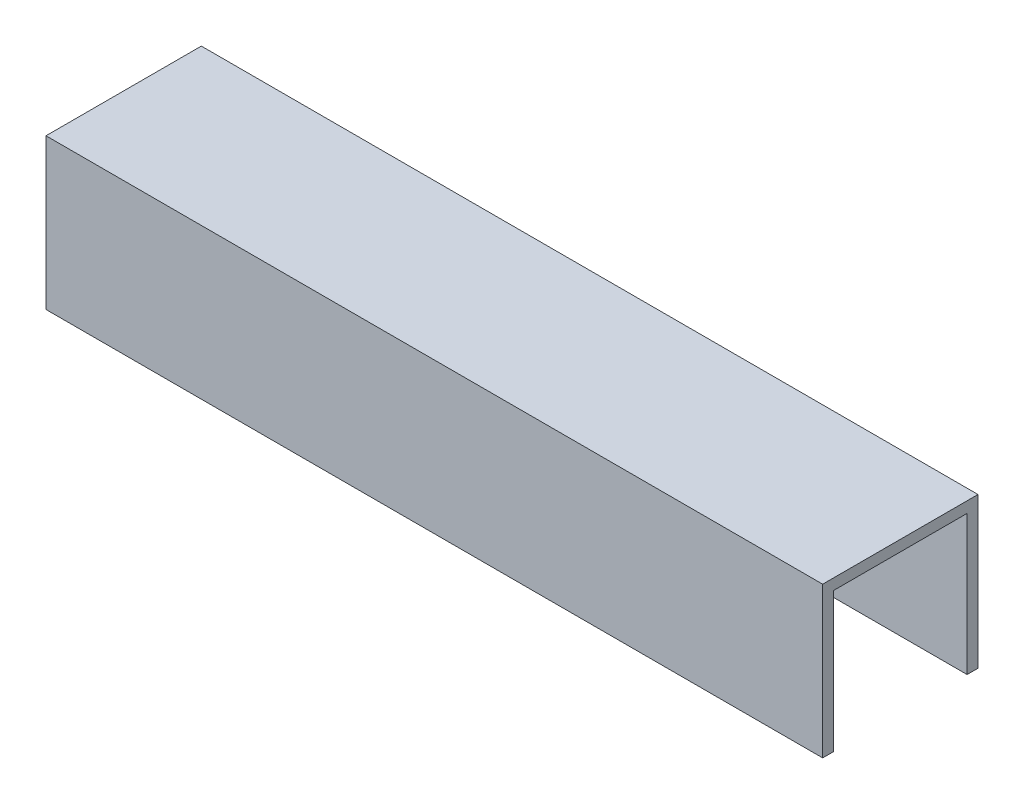
ISO-10303-21;
HEADER;
FILE_DESCRIPTION(('STEP AP214'),'2;1');
FILE_NAME('part.step','',(''),(''),'','','');
FILE_SCHEMA(('AUTOMOTIVE_DESIGN { 1 0 10303 214 1 1 1 1 }'));
ENDSEC;
DATA;
#1=APPLICATION_CONTEXT('core data for automotive mechanical design processes');
#2=APPLICATION_PROTOCOL_DEFINITION('international standard','automotive_design',2000,#1);
#3=PRODUCT_CONTEXT('',#1,'mechanical');
#4=PRODUCT('Part','Part','',(#3));
#5=PRODUCT_RELATED_PRODUCT_CATEGORY('part','',(#4));
#6=PRODUCT_DEFINITION_FORMATION('','',#4);
#7=PRODUCT_DEFINITION_CONTEXT('part definition',#1,'design');
#8=PRODUCT_DEFINITION('design','',#6,#7);
#9=PRODUCT_DEFINITION_SHAPE('','',#8);
#10=(LENGTH_UNIT() NAMED_UNIT(*) SI_UNIT(.MILLI.,.METRE.));
#11=(NAMED_UNIT(*) PLANE_ANGLE_UNIT() SI_UNIT($,.RADIAN.));
#12=(NAMED_UNIT(*) SI_UNIT($,.STERADIAN.) SOLID_ANGLE_UNIT());
#13=UNCERTAINTY_MEASURE_WITH_UNIT(LENGTH_MEASURE(1.E-05),#10,'distance_accuracy_value','');
#14=(GEOMETRIC_REPRESENTATION_CONTEXT(3) GLOBAL_UNCERTAINTY_ASSIGNED_CONTEXT((#13)) GLOBAL_UNIT_ASSIGNED_CONTEXT((#10,
#11,#12)) REPRESENTATION_CONTEXT('',''));
#15=CARTESIAN_POINT('',(0.,0.,0.));
#16=DIRECTION('',(0.,0.,1.));
#17=DIRECTION('',(1.,0.,0.));
#18=AXIS2_PLACEMENT_3D('',#15,#16,#17);
#19=CARTESIAN_POINT('',(-80.,0.,16.));
#20=DIRECTION('',(0.,-1.,0.));
#21=DIRECTION('',(0.,0.,-1.));
#22=AXIS2_PLACEMENT_3D('',#19,#20,#21);
#23=PLANE('',#22);
#24=DIRECTION('',(0.,0.,-1.));
#25=VECTOR('',#24,1.);
#26=CARTESIAN_POINT('',(80.,0.,16.));
#27=LINE('',#26,#25);
#28=CARTESIAN_POINT('',(80.,0.,16.));
#29=VERTEX_POINT('',#28);
#30=CARTESIAN_POINT('',(80.,0.,13.75));
#31=VERTEX_POINT('',#30);
#32=EDGE_CURVE('E129',#29,#31,#27,.T.);
#33=ORIENTED_EDGE('',*,*,#32,.F.);
#34=DIRECTION('',(1.,0.,0.));
#35=VECTOR('',#34,1.);
#36=CARTESIAN_POINT('',(-80.,0.,16.));
#37=LINE('',#36,#35);
#38=CARTESIAN_POINT('',(-80.,0.,16.));
#39=VERTEX_POINT('',#38);
#40=EDGE_CURVE('E11',#39,#29,#37,.T.);
#41=ORIENTED_EDGE('',*,*,#40,.F.);
#42=DIRECTION('',(0.,0.,-1.));
#43=VECTOR('',#42,1.);
#44=CARTESIAN_POINT('',(-80.,0.,16.));
#45=LINE('',#44,#43);
#46=CARTESIAN_POINT('',(-80.,0.,13.75));
#47=VERTEX_POINT('',#46);
#48=EDGE_CURVE('E149',#39,#47,#45,.T.);
#49=ORIENTED_EDGE('',*,*,#48,.T.);
#50=DIRECTION('',(1.,0.,0.));
#51=VECTOR('',#50,1.);
#52=CARTESIAN_POINT('',(-80.,0.,13.75));
#53=LINE('',#52,#51);
#54=EDGE_CURVE('E35',#47,#31,#53,.T.);
#55=ORIENTED_EDGE('',*,*,#54,.T.);
#56=EDGE_LOOP('',(#33,#41,#49,#55));
#57=FACE_BOUND('',#56,.T.);
#58=ADVANCED_FACE('F32',(#57),#23,.T.);
#59=CARTESIAN_POINT('',(-80.,31.,16.));
#60=DIRECTION('',(0.,0.,1.));
#61=DIRECTION('',(1.,0.,0.));
#62=AXIS2_PLACEMENT_3D('',#59,#60,#61);
#63=PLANE('',#62);
#64=DIRECTION('',(0.,-1.,0.));
#65=VECTOR('',#64,1.);
#66=CARTESIAN_POINT('',(80.,31.,16.));
#67=LINE('',#66,#65);
#68=CARTESIAN_POINT('',(80.,31.,16.));
#69=VERTEX_POINT('',#68);
#70=EDGE_CURVE('E147',#69,#29,#67,.T.);
#71=ORIENTED_EDGE('',*,*,#70,.F.);
#72=DIRECTION('',(1.,0.,0.));
#73=VECTOR('',#72,1.);
#74=CARTESIAN_POINT('',(-80.,31.,16.));
#75=LINE('',#74,#73);
#76=CARTESIAN_POINT('',(-80.,31.,16.));
#77=VERTEX_POINT('',#76);
#78=EDGE_CURVE('E41',#77,#69,#75,.T.);
#79=ORIENTED_EDGE('',*,*,#78,.F.);
#80=DIRECTION('',(0.,-1.,0.));
#81=VECTOR('',#80,1.);
#82=CARTESIAN_POINT('',(-80.,31.,16.));
#83=LINE('',#82,#81);
#84=EDGE_CURVE('E119',#77,#39,#83,.T.);
#85=ORIENTED_EDGE('',*,*,#84,.T.);
#86=ORIENTED_EDGE('',*,*,#40,.T.);
#87=EDGE_LOOP('',(#71,#79,#85,#86));
#88=FACE_BOUND('',#87,.T.);
#89=ADVANCED_FACE('F161',(#88),#63,.T.);
#90=CARTESIAN_POINT('',(-80.,31.,-16.));
#91=DIRECTION('',(0.,1.,0.));
#92=DIRECTION('',(0.,0.,1.));
#93=AXIS2_PLACEMENT_3D('',#90,#91,#92);
#94=PLANE('',#93);
#95=DIRECTION('',(0.,0.,1.));
#96=VECTOR('',#95,1.);
#97=CARTESIAN_POINT('',(80.,31.,-16.));
#98=LINE('',#97,#96);
#99=CARTESIAN_POINT('',(80.,31.,-16.));
#100=VERTEX_POINT('',#99);
#101=EDGE_CURVE('E106',#100,#69,#98,.T.);
#102=ORIENTED_EDGE('',*,*,#101,.F.);
#103=DIRECTION('',(1.,0.,0.));
#104=VECTOR('',#103,1.);
#105=CARTESIAN_POINT('',(-80.,31.,-16.));
#106=LINE('',#105,#104);
#107=CARTESIAN_POINT('',(-80.,31.,-16.));
#108=VERTEX_POINT('',#107);
#109=EDGE_CURVE('E101',#108,#100,#106,.T.);
#110=ORIENTED_EDGE('',*,*,#109,.F.);
#111=DIRECTION('',(0.,0.,1.));
#112=VECTOR('',#111,1.);
#113=CARTESIAN_POINT('',(-80.,31.,-16.));
#114=LINE('',#113,#112);
#115=EDGE_CURVE('E104',#108,#77,#114,.T.);
#116=ORIENTED_EDGE('',*,*,#115,.T.);
#117=ORIENTED_EDGE('',*,*,#78,.T.);
#118=EDGE_LOOP('',(#102,#110,#116,#117));
#119=FACE_BOUND('',#118,.T.);
#120=ADVANCED_FACE('F103',(#119),#94,.T.);
#121=CARTESIAN_POINT('',(-80.,0.,-16.));
#122=DIRECTION('',(0.,0.,-1.));
#123=DIRECTION('',(-1.,0.,0.));
#124=AXIS2_PLACEMENT_3D('',#121,#122,#123);
#125=PLANE('',#124);
#126=DIRECTION('',(0.,1.,0.));
#127=VECTOR('',#126,1.);
#128=CARTESIAN_POINT('',(80.,0.,-16.));
#129=LINE('',#128,#127);
#130=CARTESIAN_POINT('',(80.,0.,-16.));
#131=VERTEX_POINT('',#130);
#132=EDGE_CURVE('E144',#131,#100,#129,.T.);
#133=ORIENTED_EDGE('',*,*,#132,.F.);
#134=DIRECTION('',(1.,0.,0.));
#135=VECTOR('',#134,1.);
#136=CARTESIAN_POINT('',(-80.,0.,-16.));
#137=LINE('',#136,#135);
#138=CARTESIAN_POINT('',(-80.,0.,-16.));
#139=VERTEX_POINT('',#138);
#140=EDGE_CURVE('E111',#139,#131,#137,.T.);
#141=ORIENTED_EDGE('',*,*,#140,.F.);
#142=DIRECTION('',(0.,1.,0.));
#143=VECTOR('',#142,1.);
#144=CARTESIAN_POINT('',(-80.,0.,-16.));
#145=LINE('',#144,#143);
#146=EDGE_CURVE('E117',#139,#108,#145,.T.);
#147=ORIENTED_EDGE('',*,*,#146,.T.);
#148=ORIENTED_EDGE('',*,*,#109,.T.);
#149=EDGE_LOOP('',(#133,#141,#147,#148));
#150=FACE_BOUND('',#149,.T.);
#151=ADVANCED_FACE('F121',(#150),#125,.T.);
#152=CARTESIAN_POINT('',(-80.,0.,-13.75));
#153=DIRECTION('',(0.,-1.,0.));
#154=DIRECTION('',(0.,0.,-1.));
#155=AXIS2_PLACEMENT_3D('',#152,#153,#154);
#156=PLANE('',#155);
#157=DIRECTION('',(0.,0.,-1.));
#158=VECTOR('',#157,1.);
#159=CARTESIAN_POINT('',(80.,0.,-13.75));
#160=LINE('',#159,#158);
#161=CARTESIAN_POINT('',(80.,0.,-13.75));
#162=VERTEX_POINT('',#161);
#163=EDGE_CURVE('E141',#162,#131,#160,.T.);
#164=ORIENTED_EDGE('',*,*,#163,.F.);
#165=DIRECTION('',(1.,0.,0.));
#166=VECTOR('',#165,1.);
#167=CARTESIAN_POINT('',(-80.,0.,-13.75));
#168=LINE('',#167,#166);
#169=CARTESIAN_POINT('',(-80.,0.,-13.75));
#170=VERTEX_POINT('',#169);
#171=EDGE_CURVE('E153',#170,#162,#168,.T.);
#172=ORIENTED_EDGE('',*,*,#171,.F.);
#173=DIRECTION('',(0.,0.,-1.));
#174=VECTOR('',#173,1.);
#175=CARTESIAN_POINT('',(-80.,0.,-13.75));
#176=LINE('',#175,#174);
#177=EDGE_CURVE('E122',#170,#139,#176,.T.);
#178=ORIENTED_EDGE('',*,*,#177,.T.);
#179=ORIENTED_EDGE('',*,*,#140,.T.);
#180=EDGE_LOOP('',(#164,#172,#178,#179));
#181=FACE_BOUND('',#180,.T.);
#182=ADVANCED_FACE('F174',(#181),#156,.T.);
#183=CARTESIAN_POINT('',(-80.,28.75,-13.75));
#184=DIRECTION('',(0.,0.,1.));
#185=DIRECTION('',(0.,-1.,0.));
#186=AXIS2_PLACEMENT_3D('',#183,#184,#185);
#187=PLANE('',#186);
#188=DIRECTION('',(0.,-1.,0.));
#189=VECTOR('',#188,1.);
#190=CARTESIAN_POINT('',(80.,28.75,-13.75));
#191=LINE('',#190,#189);
#192=CARTESIAN_POINT('',(80.,28.75,-13.75));
#193=VERTEX_POINT('',#192);
#194=EDGE_CURVE('E138',#193,#162,#191,.T.);
#195=ORIENTED_EDGE('',*,*,#194,.F.);
#196=DIRECTION('',(1.,0.,0.));
#197=VECTOR('',#196,1.);
#198=CARTESIAN_POINT('',(-80.,28.75,-13.75));
#199=LINE('',#198,#197);
#200=CARTESIAN_POINT('',(-80.,28.75,-13.75));
#201=VERTEX_POINT('',#200);
#202=EDGE_CURVE('E155',#201,#193,#199,.T.);
#203=ORIENTED_EDGE('',*,*,#202,.F.);
#204=DIRECTION('',(0.,-1.,0.));
#205=VECTOR('',#204,1.);
#206=CARTESIAN_POINT('',(-80.,28.75,-13.75));
#207=LINE('',#206,#205);
#208=EDGE_CURVE('E124',#201,#170,#207,.T.);
#209=ORIENTED_EDGE('',*,*,#208,.T.);
#210=ORIENTED_EDGE('',*,*,#171,.T.);
#211=EDGE_LOOP('',(#195,#203,#209,#210));
#212=FACE_BOUND('',#211,.T.);
#213=ADVANCED_FACE('F177',(#212),#187,.T.);
#214=CARTESIAN_POINT('',(-80.,28.75,13.75));
#215=DIRECTION('',(0.,-1.,0.));
#216=DIRECTION('',(0.,0.,-1.));
#217=AXIS2_PLACEMENT_3D('',#214,#215,#216);
#218=PLANE('',#217);
#219=DIRECTION('',(0.,0.,-1.));
#220=VECTOR('',#219,1.);
#221=CARTESIAN_POINT('',(80.,28.75,13.75));
#222=LINE('',#221,#220);
#223=CARTESIAN_POINT('',(80.,28.75,13.75));
#224=VERTEX_POINT('',#223);
#225=EDGE_CURVE('E135',#224,#193,#222,.T.);
#226=ORIENTED_EDGE('',*,*,#225,.F.);
#227=DIRECTION('',(1.,0.,0.));
#228=VECTOR('',#227,1.);
#229=CARTESIAN_POINT('',(-80.,28.75,13.75));
#230=LINE('',#229,#228);
#231=CARTESIAN_POINT('',(-80.,28.75,13.75));
#232=VERTEX_POINT('',#231);
#233=EDGE_CURVE('E156',#232,#224,#230,.T.);
#234=ORIENTED_EDGE('',*,*,#233,.F.);
#235=DIRECTION('',(0.,0.,-1.));
#236=VECTOR('',#235,1.);
#237=CARTESIAN_POINT('',(-80.,28.75,13.75));
#238=LINE('',#237,#236);
#239=EDGE_CURVE('E252',#232,#201,#238,.T.);
#240=ORIENTED_EDGE('',*,*,#239,.T.);
#241=ORIENTED_EDGE('',*,*,#202,.T.);
#242=EDGE_LOOP('',(#226,#234,#240,#241));
#243=FACE_BOUND('',#242,.T.);
#244=ADVANCED_FACE('F181',(#243),#218,.T.);
#245=CARTESIAN_POINT('',(-80.,0.,13.75));
#246=DIRECTION('',(0.,0.,-1.));
#247=DIRECTION('',(0.,1.,0.));
#248=AXIS2_PLACEMENT_3D('',#245,#246,#247);
#249=PLANE('',#248);
#250=DIRECTION('',(0.,1.,0.));
#251=VECTOR('',#250,1.);
#252=CARTESIAN_POINT('',(80.,0.,13.75));
#253=LINE('',#252,#251);
#254=EDGE_CURVE('E132',#31,#224,#253,.T.);
#255=ORIENTED_EDGE('',*,*,#254,.F.);
#256=ORIENTED_EDGE('',*,*,#54,.F.);
#257=DIRECTION('',(0.,1.,0.));
#258=VECTOR('',#257,1.);
#259=CARTESIAN_POINT('',(-80.,0.,13.75));
#260=LINE('',#259,#258);
#261=EDGE_CURVE('E253',#47,#232,#260,.T.);
#262=ORIENTED_EDGE('',*,*,#261,.T.);
#263=ORIENTED_EDGE('',*,*,#233,.T.);
#264=EDGE_LOOP('',(#255,#256,#262,#263));
#265=FACE_BOUND('',#264,.T.);
#266=ADVANCED_FACE('F158',(#265),#249,.T.);
#267=CARTESIAN_POINT('',(-80.,0.,0.));
#268=DIRECTION('',(1.,0.,0.));
#269=DIRECTION('',(0.,0.,-1.));
#270=AXIS2_PLACEMENT_3D('',#267,#268,#269);
#271=PLANE('',#270);
#272=ORIENTED_EDGE('',*,*,#48,.F.);
#273=ORIENTED_EDGE('',*,*,#84,.F.);
#274=ORIENTED_EDGE('',*,*,#115,.F.);
#275=ORIENTED_EDGE('',*,*,#146,.F.);
#276=ORIENTED_EDGE('',*,*,#177,.F.);
#277=ORIENTED_EDGE('',*,*,#208,.F.);
#278=ORIENTED_EDGE('',*,*,#239,.F.);
#279=ORIENTED_EDGE('',*,*,#261,.F.);
#280=EDGE_LOOP('',(#272,#273,#274,#275,#276,#277,#278,#279));
#281=FACE_BOUND('',#280,.T.);
#282=ADVANCED_FACE('F115',(#281),#271,.F.);
#283=CARTESIAN_POINT('',(80.,0.,0.));
#284=DIRECTION('',(1.,0.,0.));
#285=DIRECTION('',(0.,0.,-1.));
#286=AXIS2_PLACEMENT_3D('',#283,#284,#285);
#287=PLANE('',#286);
#288=ORIENTED_EDGE('',*,*,#32,.T.);
#289=ORIENTED_EDGE('',*,*,#254,.T.);
#290=ORIENTED_EDGE('',*,*,#225,.T.);
#291=ORIENTED_EDGE('',*,*,#194,.T.);
#292=ORIENTED_EDGE('',*,*,#163,.T.);
#293=ORIENTED_EDGE('',*,*,#132,.T.);
#294=ORIENTED_EDGE('',*,*,#101,.T.);
#295=ORIENTED_EDGE('',*,*,#70,.T.);
#296=EDGE_LOOP('',(#288,#289,#290,#291,#292,#293,#294,#295));
#297=FACE_BOUND('',#296,.T.);
#298=ADVANCED_FACE('F160',(#297),#287,.T.);
#299=CLOSED_SHELL('',(#58,#89,#120,#151,#182,#213,#244,#266,#282,#298));
#300=MANIFOLD_SOLID_BREP('B2',#299);
#301=ADVANCED_BREP_SHAPE_REPRESENTATION('',(#18,#300),#14);
#302=SHAPE_DEFINITION_REPRESENTATION(#9,#301);
ENDSEC;
END-ISO-10303-21;
